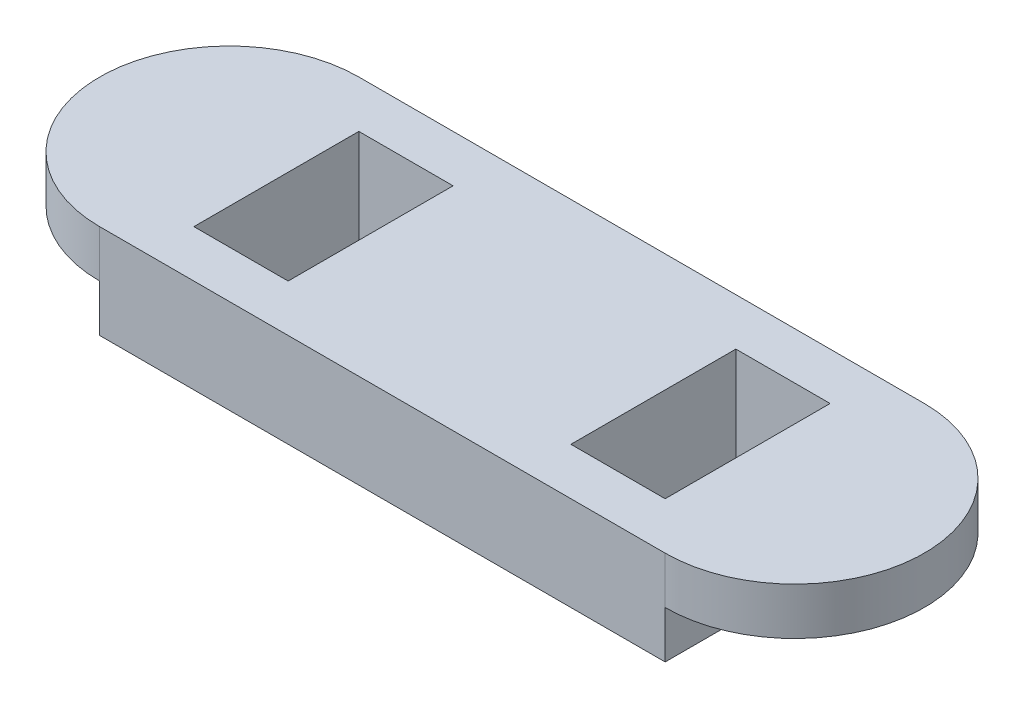
ISO-10303-21;
HEADER;
FILE_DESCRIPTION(('STEP AP214'),'2;1');
FILE_NAME('part.step','',(''),(''),'','','');
FILE_SCHEMA(('AUTOMOTIVE_DESIGN { 1 0 10303 214 1 1 1 1 }'));
ENDSEC;
DATA;
#1=APPLICATION_CONTEXT('core data for automotive mechanical design processes');
#2=APPLICATION_PROTOCOL_DEFINITION('international standard','automotive_design',2000,#1);
#3=PRODUCT_CONTEXT('',#1,'mechanical');
#4=PRODUCT('Part','Part','',(#3));
#5=PRODUCT_RELATED_PRODUCT_CATEGORY('part','',(#4));
#6=PRODUCT_DEFINITION_FORMATION('','',#4);
#7=PRODUCT_DEFINITION_CONTEXT('part definition',#1,'design');
#8=PRODUCT_DEFINITION('design','',#6,#7);
#9=PRODUCT_DEFINITION_SHAPE('','',#8);
#10=(LENGTH_UNIT() NAMED_UNIT(*) SI_UNIT(.MILLI.,.METRE.));
#11=(NAMED_UNIT(*) PLANE_ANGLE_UNIT() SI_UNIT($,.RADIAN.));
#12=(NAMED_UNIT(*) SI_UNIT($,.STERADIAN.) SOLID_ANGLE_UNIT());
#13=UNCERTAINTY_MEASURE_WITH_UNIT(LENGTH_MEASURE(1.E-05),#10,'distance_accuracy_value','');
#14=(GEOMETRIC_REPRESENTATION_CONTEXT(3) GLOBAL_UNCERTAINTY_ASSIGNED_CONTEXT((#13)) GLOBAL_UNIT_ASSIGNED_CONTEXT((#10,
#11,#12)) REPRESENTATION_CONTEXT('',''));
#15=CARTESIAN_POINT('',(0.,0.,0.));
#16=DIRECTION('',(0.,0.,1.));
#17=DIRECTION('',(1.,0.,0.));
#18=AXIS2_PLACEMENT_3D('',#15,#16,#17);
#19=CARTESIAN_POINT('',(60.,20.,27.5));
#20=DIRECTION('',(-1.,0.,0.));
#21=DIRECTION('',(0.,0.,1.));
#22=AXIS2_PLACEMENT_3D('',#19,#20,#21);
#23=PLANE('',#22);
#24=DIRECTION('',(0.,0.,-1.));
#25=VECTOR('',#24,1.);
#26=CARTESIAN_POINT('',(60.,10.,0.));
#27=LINE('',#26,#25);
#28=CARTESIAN_POINT('',(60.,10.,27.5));
#29=VERTEX_POINT('',#28);
#30=CARTESIAN_POINT('',(60.,10.,-27.5));
#31=VERTEX_POINT('',#30);
#32=EDGE_CURVE('E156',#29,#31,#27,.T.);
#33=ORIENTED_EDGE('',*,*,#32,.F.);
#34=DIRECTION('',(0.,-1.,0.));
#35=VECTOR('',#34,1.);
#36=CARTESIAN_POINT('',(60.,20.,27.5));
#37=LINE('',#36,#35);
#38=CARTESIAN_POINT('',(60.,0.,27.5));
#39=VERTEX_POINT('',#38);
#40=EDGE_CURVE('E143',#29,#39,#37,.T.);
#41=ORIENTED_EDGE('',*,*,#40,.T.);
#42=DIRECTION('',(0.,0.,-1.));
#43=VECTOR('',#42,1.);
#44=CARTESIAN_POINT('',(60.,0.,27.5));
#45=LINE('',#44,#43);
#46=CARTESIAN_POINT('',(60.,0.,-27.5));
#47=VERTEX_POINT('',#46);
#48=EDGE_CURVE('E203',#39,#47,#45,.T.);
#49=ORIENTED_EDGE('',*,*,#48,.T.);
#50=DIRECTION('',(0.,-1.,0.));
#51=VECTOR('',#50,1.);
#52=CARTESIAN_POINT('',(60.,20.,-27.5));
#53=LINE('',#52,#51);
#54=EDGE_CURVE('E51',#31,#47,#53,.T.);
#55=ORIENTED_EDGE('',*,*,#54,.F.);
#56=EDGE_LOOP('',(#33,#41,#49,#55));
#57=FACE_BOUND('',#56,.T.);
#58=ADVANCED_FACE('F43',(#57),#23,.F.);
#59=CARTESIAN_POINT('',(-60.,20.,27.5));
#60=DIRECTION('',(1.,0.,0.));
#61=DIRECTION('',(0.,0.,-1.));
#62=AXIS2_PLACEMENT_3D('',#59,#60,#61);
#63=PLANE('',#62);
#64=DIRECTION('',(0.,0.,1.));
#65=VECTOR('',#64,1.);
#66=CARTESIAN_POINT('',(-60.,10.,0.));
#67=LINE('',#66,#65);
#68=CARTESIAN_POINT('',(-60.,10.,-27.5));
#69=VERTEX_POINT('',#68);
#70=CARTESIAN_POINT('',(-60.,10.,27.5));
#71=VERTEX_POINT('',#70);
#72=EDGE_CURVE('E196',#69,#71,#67,.T.);
#73=ORIENTED_EDGE('',*,*,#72,.F.);
#74=DIRECTION('',(0.,-1.,0.));
#75=VECTOR('',#74,1.);
#76=CARTESIAN_POINT('',(-60.,20.,-27.5));
#77=LINE('',#76,#75);
#78=CARTESIAN_POINT('',(-60.,0.,-27.5));
#79=VERTEX_POINT('',#78);
#80=EDGE_CURVE('E181',#69,#79,#77,.T.);
#81=ORIENTED_EDGE('',*,*,#80,.T.);
#82=DIRECTION('',(0.,0.,1.));
#83=VECTOR('',#82,1.);
#84=CARTESIAN_POINT('',(-60.,0.,27.5));
#85=LINE('',#84,#83);
#86=CARTESIAN_POINT('',(-60.,0.,27.5));
#87=VERTEX_POINT('',#86);
#88=EDGE_CURVE('E195',#79,#87,#85,.T.);
#89=ORIENTED_EDGE('',*,*,#88,.T.);
#90=DIRECTION('',(0.,-1.,0.));
#91=VECTOR('',#90,1.);
#92=CARTESIAN_POINT('',(-60.,20.,27.5));
#93=LINE('',#92,#91);
#94=EDGE_CURVE('E173',#71,#87,#93,.T.);
#95=ORIENTED_EDGE('',*,*,#94,.F.);
#96=EDGE_LOOP('',(#73,#81,#89,#95));
#97=FACE_BOUND('',#96,.T.);
#98=ADVANCED_FACE('F192',(#97),#63,.F.);
#99=CARTESIAN_POINT('',(0.,20.,0.));
#100=DIRECTION('',(0.,-1.,0.));
#101=DIRECTION('',(0.,0.,-1.));
#102=AXIS2_PLACEMENT_3D('',#99,#100,#101);
#103=PLANE('',#102);
#104=DIRECTION('',(1.,0.,0.));
#105=VECTOR('',#104,1.);
#106=CARTESIAN_POINT('',(0.,20.,17.5));
#107=LINE('',#106,#105);
#108=CARTESIAN_POINT('',(30.,20.,17.5));
#109=VERTEX_POINT('',#108);
#110=CARTESIAN_POINT('',(50.,20.,17.5));
#111=VERTEX_POINT('',#110);
#112=EDGE_CURVE('E238',#109,#111,#107,.T.);
#113=ORIENTED_EDGE('',*,*,#112,.F.);
#114=DIRECTION('',(0.,0.,-1.));
#115=VECTOR('',#114,1.);
#116=CARTESIAN_POINT('',(30.,20.,0.));
#117=LINE('',#116,#115);
#118=CARTESIAN_POINT('',(30.,20.,-17.5));
#119=VERTEX_POINT('',#118);
#120=EDGE_CURVE('E258',#109,#119,#117,.T.);
#121=ORIENTED_EDGE('',*,*,#120,.T.);
#122=DIRECTION('',(1.,0.,0.));
#123=VECTOR('',#122,1.);
#124=CARTESIAN_POINT('',(0.,20.,-17.5));
#125=LINE('',#124,#123);
#126=CARTESIAN_POINT('',(50.,20.,-17.5));
#127=VERTEX_POINT('',#126);
#128=EDGE_CURVE('E254',#119,#127,#125,.T.);
#129=ORIENTED_EDGE('',*,*,#128,.T.);
#130=DIRECTION('',(0.,0.,1.));
#131=VECTOR('',#130,1.);
#132=CARTESIAN_POINT('',(50.,20.,0.));
#133=LINE('',#132,#131);
#134=EDGE_CURVE('E224',#127,#111,#133,.T.);
#135=ORIENTED_EDGE('',*,*,#134,.T.);
#136=EDGE_LOOP('',(#113,#121,#129,#135));
#137=FACE_BOUND('',#136,.T.);
#138=DIRECTION('',(1.,0.,0.));
#139=VECTOR('',#138,1.);
#140=CARTESIAN_POINT('',(-60.,20.,27.5));
#141=LINE('',#140,#139);
#142=CARTESIAN_POINT('',(-60.,20.,27.5));
#143=VERTEX_POINT('',#142);
#144=CARTESIAN_POINT('',(60.,20.,27.5));
#145=VERTEX_POINT('',#144);
#146=EDGE_CURVE('E153',#143,#145,#141,.T.);
#147=ORIENTED_EDGE('',*,*,#146,.T.);
#148=CARTESIAN_POINT('',(60.,20.,0.));
#149=DIRECTION('',(0.,1.,0.));
#150=DIRECTION('',(0.,0.,1.));
#151=AXIS2_PLACEMENT_3D('',#148,#149,#150);
#152=CIRCLE('',#151,27.5);
#153=CARTESIAN_POINT('',(60.,20.,-27.5));
#154=VERTEX_POINT('',#153);
#155=EDGE_CURVE('E168',#154,#145,#152,.F.);
#156=ORIENTED_EDGE('',*,*,#155,.F.);
#157=DIRECTION('',(-1.,0.,0.));
#158=VECTOR('',#157,1.);
#159=CARTESIAN_POINT('',(-60.,20.,-27.5));
#160=LINE('',#159,#158);
#161=CARTESIAN_POINT('',(-60.,20.,-27.5));
#162=VERTEX_POINT('',#161);
#163=EDGE_CURVE('E209',#154,#162,#160,.T.);
#164=ORIENTED_EDGE('',*,*,#163,.T.);
#165=CARTESIAN_POINT('',(-60.,20.,0.));
#166=DIRECTION('',(0.,1.,0.));
#167=DIRECTION('',(0.,0.,1.));
#168=AXIS2_PLACEMENT_3D('',#165,#166,#167);
#169=CIRCLE('',#168,27.5);
#170=EDGE_CURVE('E161',#162,#143,#169,.T.);
#171=ORIENTED_EDGE('',*,*,#170,.T.);
#172=EDGE_LOOP('',(#147,#156,#164,#171));
#173=FACE_BOUND('',#172,.T.);
#174=DIRECTION('',(0.,0.,-1.));
#175=VECTOR('',#174,1.);
#176=CARTESIAN_POINT('',(-30.,20.,0.));
#177=LINE('',#176,#175);
#178=CARTESIAN_POINT('',(-30.,20.,17.5));
#179=VERTEX_POINT('',#178);
#180=CARTESIAN_POINT('',(-30.,20.,-17.5));
#181=VERTEX_POINT('',#180);
#182=EDGE_CURVE('E281',#179,#181,#177,.T.);
#183=ORIENTED_EDGE('',*,*,#182,.F.);
#184=DIRECTION('',(1.,0.,0.));
#185=VECTOR('',#184,1.);
#186=CARTESIAN_POINT('',(0.,20.,17.5));
#187=LINE('',#186,#185);
#188=CARTESIAN_POINT('',(-50.,20.,17.5));
#189=VERTEX_POINT('',#188);
#190=EDGE_CURVE('E300',#189,#179,#187,.T.);
#191=ORIENTED_EDGE('',*,*,#190,.F.);
#192=DIRECTION('',(0.,0.,1.));
#193=VECTOR('',#192,1.);
#194=CARTESIAN_POINT('',(-50.,20.,0.));
#195=LINE('',#194,#193);
#196=CARTESIAN_POINT('',(-50.,20.,-17.5));
#197=VERTEX_POINT('',#196);
#198=EDGE_CURVE('E296',#197,#189,#195,.T.);
#199=ORIENTED_EDGE('',*,*,#198,.F.);
#200=DIRECTION('',(1.,0.,0.));
#201=VECTOR('',#200,1.);
#202=CARTESIAN_POINT('',(0.,20.,-17.5));
#203=LINE('',#202,#201);
#204=EDGE_CURVE('E269',#197,#181,#203,.T.);
#205=ORIENTED_EDGE('',*,*,#204,.T.);
#206=EDGE_LOOP('',(#183,#191,#199,#205));
#207=FACE_BOUND('',#206,.T.);
#208=ADVANCED_FACE('F317',(#137,#173,#207),#103,.F.);
#209=CARTESIAN_POINT('',(0.,0.,0.));
#210=DIRECTION('',(0.,-1.,0.));
#211=DIRECTION('',(0.,0.,-1.));
#212=AXIS2_PLACEMENT_3D('',#209,#210,#211);
#213=PLANE('',#212);
#214=ORIENTED_EDGE('',*,*,#48,.F.);
#215=DIRECTION('',(1.,0.,0.));
#216=VECTOR('',#215,1.);
#217=CARTESIAN_POINT('',(-60.,0.,27.5));
#218=LINE('',#217,#216);
#219=EDGE_CURVE('E150',#87,#39,#218,.T.);
#220=ORIENTED_EDGE('',*,*,#219,.F.);
#221=ORIENTED_EDGE('',*,*,#88,.F.);
#222=DIRECTION('',(-1.,0.,0.));
#223=VECTOR('',#222,1.);
#224=CARTESIAN_POINT('',(-60.,0.,-27.5));
#225=LINE('',#224,#223);
#226=EDGE_CURVE('E199',#47,#79,#225,.T.);
#227=ORIENTED_EDGE('',*,*,#226,.F.);
#228=EDGE_LOOP('',(#214,#220,#221,#227));
#229=FACE_BOUND('',#228,.T.);
#230=DIRECTION('',(0.,0.,-1.));
#231=VECTOR('',#230,1.);
#232=CARTESIAN_POINT('',(30.,0.,0.));
#233=LINE('',#232,#231);
#234=CARTESIAN_POINT('',(30.,0.,17.5));
#235=VERTEX_POINT('',#234);
#236=CARTESIAN_POINT('',(30.,0.,-17.5));
#237=VERTEX_POINT('',#236);
#238=EDGE_CURVE('E243',#235,#237,#233,.T.);
#239=ORIENTED_EDGE('',*,*,#238,.F.);
#240=DIRECTION('',(1.,0.,0.));
#241=VECTOR('',#240,1.);
#242=CARTESIAN_POINT('',(0.,0.,17.5));
#243=LINE('',#242,#241);
#244=CARTESIAN_POINT('',(50.,0.,17.5));
#245=VERTEX_POINT('',#244);
#246=EDGE_CURVE('E247',#235,#245,#243,.T.);
#247=ORIENTED_EDGE('',*,*,#246,.T.);
#248=DIRECTION('',(0.,0.,1.));
#249=VECTOR('',#248,1.);
#250=CARTESIAN_POINT('',(50.,0.,0.));
#251=LINE('',#250,#249);
#252=CARTESIAN_POINT('',(50.,0.,-17.5));
#253=VERTEX_POINT('',#252);
#254=EDGE_CURVE('E234',#253,#245,#251,.T.);
#255=ORIENTED_EDGE('',*,*,#254,.F.);
#256=DIRECTION('',(1.,0.,0.));
#257=VECTOR('',#256,1.);
#258=CARTESIAN_POINT('',(0.,0.,-17.5));
#259=LINE('',#258,#257);
#260=EDGE_CURVE('E239',#237,#253,#259,.T.);
#261=ORIENTED_EDGE('',*,*,#260,.F.);
#262=EDGE_LOOP('',(#239,#247,#255,#261));
#263=FACE_BOUND('',#262,.T.);
#264=DIRECTION('',(1.,0.,0.));
#265=VECTOR('',#264,1.);
#266=CARTESIAN_POINT('',(0.,0.,17.5));
#267=LINE('',#266,#265);
#268=CARTESIAN_POINT('',(-50.,0.,17.5));
#269=VERTEX_POINT('',#268);
#270=CARTESIAN_POINT('',(-30.,0.,17.5));
#271=VERTEX_POINT('',#270);
#272=EDGE_CURVE('E286',#269,#271,#267,.T.);
#273=ORIENTED_EDGE('',*,*,#272,.T.);
#274=DIRECTION('',(0.,0.,-1.));
#275=VECTOR('',#274,1.);
#276=CARTESIAN_POINT('',(-30.,0.,0.));
#277=LINE('',#276,#275);
#278=CARTESIAN_POINT('',(-30.,0.,-17.5));
#279=VERTEX_POINT('',#278);
#280=EDGE_CURVE('E233',#271,#279,#277,.T.);
#281=ORIENTED_EDGE('',*,*,#280,.T.);
#282=DIRECTION('',(1.,0.,0.));
#283=VECTOR('',#282,1.);
#284=CARTESIAN_POINT('',(0.,0.,-17.5));
#285=LINE('',#284,#283);
#286=CARTESIAN_POINT('',(-50.,0.,-17.5));
#287=VERTEX_POINT('',#286);
#288=EDGE_CURVE('E277',#287,#279,#285,.T.);
#289=ORIENTED_EDGE('',*,*,#288,.F.);
#290=DIRECTION('',(0.,0.,1.));
#291=VECTOR('',#290,1.);
#292=CARTESIAN_POINT('',(-50.,0.,0.));
#293=LINE('',#292,#291);
#294=EDGE_CURVE('E282',#287,#269,#293,.T.);
#295=ORIENTED_EDGE('',*,*,#294,.T.);
#296=EDGE_LOOP('',(#273,#281,#289,#295));
#297=FACE_BOUND('',#296,.T.);
#298=ADVANCED_FACE('F205',(#229,#263,#297),#213,.T.);
#299=CARTESIAN_POINT('',(-60.,20.,-27.5));
#300=DIRECTION('',(0.,0.,1.));
#301=DIRECTION('',(1.,0.,0.));
#302=AXIS2_PLACEMENT_3D('',#299,#300,#301);
#303=PLANE('',#302);
#304=ORIENTED_EDGE('',*,*,#226,.T.);
#305=ORIENTED_EDGE('',*,*,#80,.F.);
#306=EDGE_CURVE('E182',#162,#69,#77,.T.);
#307=ORIENTED_EDGE('',*,*,#306,.F.);
#308=ORIENTED_EDGE('',*,*,#163,.F.);
#309=EDGE_CURVE('E11',#154,#31,#53,.T.);
#310=ORIENTED_EDGE('',*,*,#309,.T.);
#311=ORIENTED_EDGE('',*,*,#54,.T.);
#312=EDGE_LOOP('',(#304,#305,#307,#308,#310,#311));
#313=FACE_BOUND('',#312,.T.);
#314=ADVANCED_FACE('F200',(#313),#303,.F.);
#315=CARTESIAN_POINT('',(-60.,20.,27.5));
#316=DIRECTION('',(0.,0.,-1.));
#317=DIRECTION('',(-1.,0.,0.));
#318=AXIS2_PLACEMENT_3D('',#315,#316,#317);
#319=PLANE('',#318);
#320=ORIENTED_EDGE('',*,*,#219,.T.);
#321=ORIENTED_EDGE('',*,*,#40,.F.);
#322=EDGE_CURVE('E147',#145,#29,#37,.T.);
#323=ORIENTED_EDGE('',*,*,#322,.F.);
#324=ORIENTED_EDGE('',*,*,#146,.F.);
#325=EDGE_CURVE('E175',#143,#71,#93,.T.);
#326=ORIENTED_EDGE('',*,*,#325,.T.);
#327=ORIENTED_EDGE('',*,*,#94,.T.);
#328=EDGE_LOOP('',(#320,#321,#323,#324,#326,#327));
#329=FACE_BOUND('',#328,.T.);
#330=ADVANCED_FACE('F144',(#329),#319,.F.);
#331=CARTESIAN_POINT('',(0.,20.,17.5));
#332=DIRECTION('',(0.,0.,-1.));
#333=DIRECTION('',(-1.,0.,0.));
#334=AXIS2_PLACEMENT_3D('',#331,#332,#333);
#335=PLANE('',#334);
#336=ORIENTED_EDGE('',*,*,#246,.F.);
#337=DIRECTION('',(0.,-1.,0.));
#338=VECTOR('',#337,1.);
#339=CARTESIAN_POINT('',(30.,20.,17.5));
#340=LINE('',#339,#338);
#341=EDGE_CURVE('E219',#109,#235,#340,.T.);
#342=ORIENTED_EDGE('',*,*,#341,.F.);
#343=ORIENTED_EDGE('',*,*,#112,.T.);
#344=DIRECTION('',(0.,-1.,0.));
#345=VECTOR('',#344,1.);
#346=CARTESIAN_POINT('',(50.,20.,17.5));
#347=LINE('',#346,#345);
#348=EDGE_CURVE('E230',#111,#245,#347,.T.);
#349=ORIENTED_EDGE('',*,*,#348,.T.);
#350=EDGE_LOOP('',(#336,#342,#343,#349));
#351=FACE_BOUND('',#350,.T.);
#352=ADVANCED_FACE('F362',(#351),#335,.T.);
#353=CARTESIAN_POINT('',(50.,20.,0.));
#354=DIRECTION('',(1.,0.,0.));
#355=DIRECTION('',(0.,0.,-1.));
#356=AXIS2_PLACEMENT_3D('',#353,#354,#355);
#357=PLANE('',#356);
#358=ORIENTED_EDGE('',*,*,#254,.T.);
#359=ORIENTED_EDGE('',*,*,#348,.F.);
#360=ORIENTED_EDGE('',*,*,#134,.F.);
#361=DIRECTION('',(0.,-1.,0.));
#362=VECTOR('',#361,1.);
#363=CARTESIAN_POINT('',(50.,20.,-17.5));
#364=LINE('',#363,#362);
#365=EDGE_CURVE('E227',#127,#253,#364,.T.);
#366=ORIENTED_EDGE('',*,*,#365,.T.);
#367=EDGE_LOOP('',(#358,#359,#360,#366));
#368=FACE_BOUND('',#367,.T.);
#369=ADVANCED_FACE('F368',(#368),#357,.F.);
#370=CARTESIAN_POINT('',(0.,20.,-17.5));
#371=DIRECTION('',(0.,0.,-1.));
#372=DIRECTION('',(-1.,0.,0.));
#373=AXIS2_PLACEMENT_3D('',#370,#371,#372);
#374=PLANE('',#373);
#375=ORIENTED_EDGE('',*,*,#260,.T.);
#376=ORIENTED_EDGE('',*,*,#365,.F.);
#377=ORIENTED_EDGE('',*,*,#128,.F.);
#378=DIRECTION('',(0.,-1.,0.));
#379=VECTOR('',#378,1.);
#380=CARTESIAN_POINT('',(30.,20.,-17.5));
#381=LINE('',#380,#379);
#382=EDGE_CURVE('E223',#119,#237,#381,.T.);
#383=ORIENTED_EDGE('',*,*,#382,.T.);
#384=EDGE_LOOP('',(#375,#376,#377,#383));
#385=FACE_BOUND('',#384,.T.);
#386=ADVANCED_FACE('F373',(#385),#374,.F.);
#387=CARTESIAN_POINT('',(30.,20.,0.));
#388=DIRECTION('',(-1.,0.,0.));
#389=DIRECTION('',(0.,0.,1.));
#390=AXIS2_PLACEMENT_3D('',#387,#388,#389);
#391=PLANE('',#390);
#392=ORIENTED_EDGE('',*,*,#238,.T.);
#393=ORIENTED_EDGE('',*,*,#382,.F.);
#394=ORIENTED_EDGE('',*,*,#120,.F.);
#395=ORIENTED_EDGE('',*,*,#341,.T.);
#396=EDGE_LOOP('',(#392,#393,#394,#395));
#397=FACE_BOUND('',#396,.T.);
#398=ADVANCED_FACE('F370',(#397),#391,.F.);
#399=CARTESIAN_POINT('',(-30.,20.,0.));
#400=DIRECTION('',(-1.,0.,0.));
#401=DIRECTION('',(0.,0.,1.));
#402=AXIS2_PLACEMENT_3D('',#399,#400,#401);
#403=PLANE('',#402);
#404=ORIENTED_EDGE('',*,*,#280,.F.);
#405=DIRECTION('',(0.,-1.,0.));
#406=VECTOR('',#405,1.);
#407=CARTESIAN_POINT('',(-30.,20.,17.5));
#408=LINE('',#407,#406);
#409=EDGE_CURVE('E264',#179,#271,#408,.T.);
#410=ORIENTED_EDGE('',*,*,#409,.F.);
#411=ORIENTED_EDGE('',*,*,#182,.T.);
#412=DIRECTION('',(0.,-1.,0.));
#413=VECTOR('',#412,1.);
#414=CARTESIAN_POINT('',(-30.,20.,-17.5));
#415=LINE('',#414,#413);
#416=EDGE_CURVE('E213',#181,#279,#415,.T.);
#417=ORIENTED_EDGE('',*,*,#416,.T.);
#418=EDGE_LOOP('',(#404,#410,#411,#417));
#419=FACE_BOUND('',#418,.T.);
#420=ADVANCED_FACE('F329',(#419),#403,.T.);
#421=CARTESIAN_POINT('',(0.,20.,-17.5));
#422=DIRECTION('',(0.,0.,-1.));
#423=DIRECTION('',(-1.,0.,0.));
#424=AXIS2_PLACEMENT_3D('',#421,#422,#423);
#425=PLANE('',#424);
#426=ORIENTED_EDGE('',*,*,#288,.T.);
#427=ORIENTED_EDGE('',*,*,#416,.F.);
#428=ORIENTED_EDGE('',*,*,#204,.F.);
#429=DIRECTION('',(0.,-1.,0.));
#430=VECTOR('',#429,1.);
#431=CARTESIAN_POINT('',(-50.,20.,-17.5));
#432=LINE('',#431,#430);
#433=EDGE_CURVE('E272',#197,#287,#432,.T.);
#434=ORIENTED_EDGE('',*,*,#433,.T.);
#435=EDGE_LOOP('',(#426,#427,#428,#434));
#436=FACE_BOUND('',#435,.T.);
#437=ADVANCED_FACE('F331',(#436),#425,.F.);
#438=CARTESIAN_POINT('',(-50.,20.,0.));
#439=DIRECTION('',(1.,0.,0.));
#440=DIRECTION('',(0.,0.,-1.));
#441=AXIS2_PLACEMENT_3D('',#438,#439,#440);
#442=PLANE('',#441);
#443=ORIENTED_EDGE('',*,*,#294,.F.);
#444=ORIENTED_EDGE('',*,*,#433,.F.);
#445=ORIENTED_EDGE('',*,*,#198,.T.);
#446=DIRECTION('',(0.,-1.,0.));
#447=VECTOR('',#446,1.);
#448=CARTESIAN_POINT('',(-50.,20.,17.5));
#449=LINE('',#448,#447);
#450=EDGE_CURVE('E268',#189,#269,#449,.T.);
#451=ORIENTED_EDGE('',*,*,#450,.T.);
#452=EDGE_LOOP('',(#443,#444,#445,#451));
#453=FACE_BOUND('',#452,.T.);
#454=ADVANCED_FACE('F339',(#453),#442,.T.);
#455=CARTESIAN_POINT('',(0.,20.,17.5));
#456=DIRECTION('',(0.,0.,-1.));
#457=DIRECTION('',(-1.,0.,0.));
#458=AXIS2_PLACEMENT_3D('',#455,#456,#457);
#459=PLANE('',#458);
#460=ORIENTED_EDGE('',*,*,#272,.F.);
#461=ORIENTED_EDGE('',*,*,#450,.F.);
#462=ORIENTED_EDGE('',*,*,#190,.T.);
#463=ORIENTED_EDGE('',*,*,#409,.T.);
#464=EDGE_LOOP('',(#460,#461,#462,#463));
#465=FACE_BOUND('',#464,.T.);
#466=ADVANCED_FACE('F337',(#465),#459,.T.);
#467=CARTESIAN_POINT('',(-60.,10.,0.));
#468=DIRECTION('',(0.,1.,0.));
#469=DIRECTION('',(0.,0.,1.));
#470=AXIS2_PLACEMENT_3D('',#467,#468,#469);
#471=CYLINDRICAL_SURFACE('',#470,27.5);
#472=ORIENTED_EDGE('',*,*,#170,.F.);
#473=ORIENTED_EDGE('',*,*,#306,.T.);
#474=CARTESIAN_POINT('',(-60.,10.,0.));
#475=DIRECTION('',(0.,1.,0.));
#476=DIRECTION('',(0.,0.,1.));
#477=AXIS2_PLACEMENT_3D('',#474,#475,#476);
#478=CIRCLE('',#477,27.5);
#479=EDGE_CURVE('E64',#69,#71,#478,.T.);
#480=ORIENTED_EDGE('',*,*,#479,.T.);
#481=ORIENTED_EDGE('',*,*,#325,.F.);
#482=EDGE_LOOP('',(#472,#473,#480,#481));
#483=FACE_BOUND('',#482,.T.);
#484=ADVANCED_FACE('F315',(#483),#471,.T.);
#485=CARTESIAN_POINT('',(0.,10.,0.));
#486=DIRECTION('',(0.,1.,0.));
#487=DIRECTION('',(0.,0.,1.));
#488=AXIS2_PLACEMENT_3D('',#485,#486,#487);
#489=PLANE('',#488);
#490=ORIENTED_EDGE('',*,*,#72,.T.);
#491=ORIENTED_EDGE('',*,*,#479,.F.);
#492=EDGE_LOOP('',(#490,#491));
#493=FACE_BOUND('',#492,.T.);
#494=ADVANCED_FACE('F314',(#493),#489,.F.);
#495=CARTESIAN_POINT('',(60.,10.,0.));
#496=DIRECTION('',(0.,1.,0.));
#497=DIRECTION('',(0.,0.,1.));
#498=AXIS2_PLACEMENT_3D('',#495,#496,#497);
#499=CYLINDRICAL_SURFACE('',#498,27.5);
#500=ORIENTED_EDGE('',*,*,#155,.T.);
#501=ORIENTED_EDGE('',*,*,#322,.T.);
#502=CARTESIAN_POINT('',(60.,10.,0.));
#503=DIRECTION('',(0.,1.,0.));
#504=DIRECTION('',(0.,0.,1.));
#505=AXIS2_PLACEMENT_3D('',#502,#503,#504);
#506=CIRCLE('',#505,27.5);
#507=EDGE_CURVE('E162',#31,#29,#506,.F.);
#508=ORIENTED_EDGE('',*,*,#507,.F.);
#509=ORIENTED_EDGE('',*,*,#309,.F.);
#510=EDGE_LOOP('',(#500,#501,#508,#509));
#511=FACE_BOUND('',#510,.T.);
#512=ADVANCED_FACE('F170',(#511),#499,.T.);
#513=CARTESIAN_POINT('',(0.,10.,0.));
#514=DIRECTION('',(0.,1.,0.));
#515=DIRECTION('',(0.,0.,1.));
#516=AXIS2_PLACEMENT_3D('',#513,#514,#515);
#517=PLANE('',#516);
#518=ORIENTED_EDGE('',*,*,#507,.T.);
#519=ORIENTED_EDGE('',*,*,#32,.T.);
#520=EDGE_LOOP('',(#518,#519));
#521=FACE_BOUND('',#520,.T.);
#522=ADVANCED_FACE('F164',(#521),#517,.F.);
#523=CLOSED_SHELL('',(#58,#98,#208,#298,#314,#330,#352,#369,#386,#398,#420,#437,#454,#466,#484,
#494,#512,#522));
#524=MANIFOLD_SOLID_BREP('B2',#523);
#525=ADVANCED_BREP_SHAPE_REPRESENTATION('',(#18,#524),#14);
#526=SHAPE_DEFINITION_REPRESENTATION(#9,#525);
ENDSEC;
END-ISO-10303-21;
